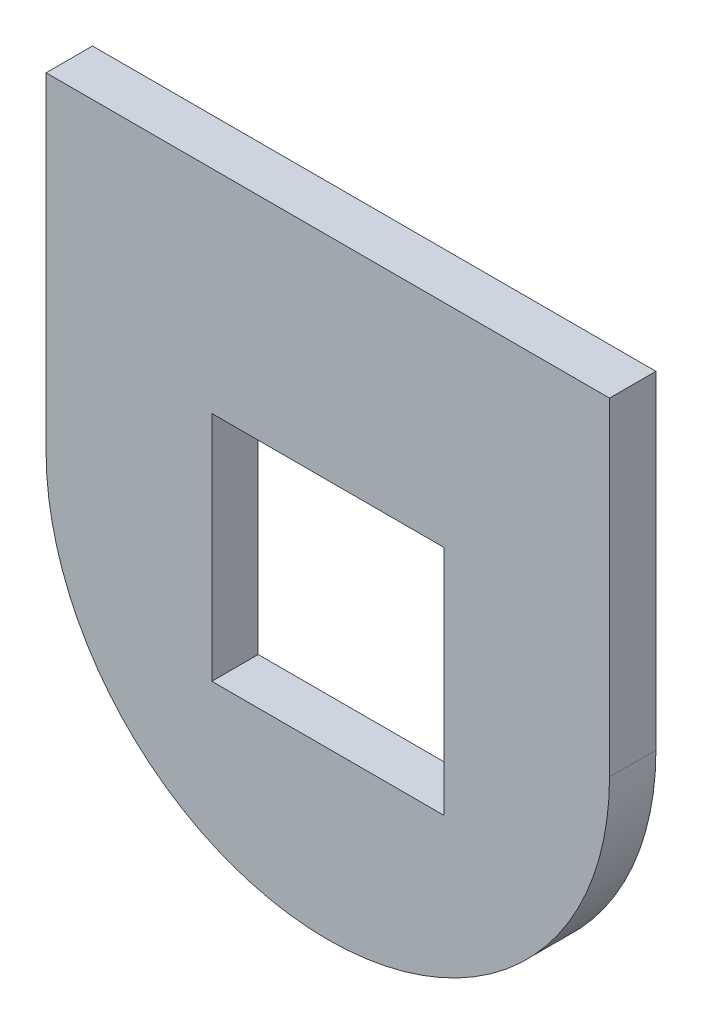
ISO-10303-21;
HEADER;
FILE_DESCRIPTION(('STEP AP214'),'2;1');
FILE_NAME('part.step','',(''),(''),'','','');
FILE_SCHEMA(('AUTOMOTIVE_DESIGN { 1 0 10303 214 1 1 1 1 }'));
ENDSEC;
DATA;
#1=APPLICATION_CONTEXT('core data for automotive mechanical design processes');
#2=APPLICATION_PROTOCOL_DEFINITION('international standard','automotive_design',2000,#1);
#3=PRODUCT_CONTEXT('',#1,'mechanical');
#4=PRODUCT('Part','Part','',(#3));
#5=PRODUCT_RELATED_PRODUCT_CATEGORY('part','',(#4));
#6=PRODUCT_DEFINITION_FORMATION('','',#4);
#7=PRODUCT_DEFINITION_CONTEXT('part definition',#1,'design');
#8=PRODUCT_DEFINITION('design','',#6,#7);
#9=PRODUCT_DEFINITION_SHAPE('','',#8);
#10=(LENGTH_UNIT() NAMED_UNIT(*) SI_UNIT(.MILLI.,.METRE.));
#11=(NAMED_UNIT(*) PLANE_ANGLE_UNIT() SI_UNIT($,.RADIAN.));
#12=(NAMED_UNIT(*) SI_UNIT($,.STERADIAN.) SOLID_ANGLE_UNIT());
#13=UNCERTAINTY_MEASURE_WITH_UNIT(LENGTH_MEASURE(1.E-05),#10,'distance_accuracy_value','');
#14=(GEOMETRIC_REPRESENTATION_CONTEXT(3) GLOBAL_UNCERTAINTY_ASSIGNED_CONTEXT((#13)) GLOBAL_UNIT_ASSIGNED_CONTEXT((#10,
#11,#12)) REPRESENTATION_CONTEXT('',''));
#15=CARTESIAN_POINT('',(0.,0.,0.));
#16=DIRECTION('',(0.,0.,1.));
#17=DIRECTION('',(1.,0.,0.));
#18=AXIS2_PLACEMENT_3D('',#15,#16,#17);
#19=CARTESIAN_POINT('',(85.,0.,7.));
#20=DIRECTION('',(-1.,0.,0.));
#21=DIRECTION('',(0.,0.,1.));
#22=AXIS2_PLACEMENT_3D('',#19,#20,#21);
#23=PLANE('',#22);
#24=DIRECTION('',(0.,1.,0.));
#25=VECTOR('',#24,1.);
#26=CARTESIAN_POINT('',(85.,0.,0.));
#27=LINE('',#26,#25);
#28=CARTESIAN_POINT('',(85.,45.,0.));
#29=VERTEX_POINT('',#28);
#30=CARTESIAN_POINT('',(85.,94.5,0.));
#31=VERTEX_POINT('',#30);
#32=EDGE_CURVE('E46',#29,#31,#27,.T.);
#33=ORIENTED_EDGE('',*,*,#32,.T.);
#34=DIRECTION('',(0.,0.,-1.));
#35=VECTOR('',#34,1.);
#36=CARTESIAN_POINT('',(85.,94.5,7.));
#37=LINE('',#36,#35);
#38=CARTESIAN_POINT('',(85.,94.5,7.));
#39=VERTEX_POINT('',#38);
#40=EDGE_CURVE('E60',#39,#31,#37,.T.);
#41=ORIENTED_EDGE('',*,*,#40,.F.);
#42=DIRECTION('',(0.,1.,0.));
#43=VECTOR('',#42,1.);
#44=CARTESIAN_POINT('',(85.,0.,7.));
#45=LINE('',#44,#43);
#46=CARTESIAN_POINT('',(85.,45.,7.));
#47=VERTEX_POINT('',#46);
#48=EDGE_CURVE('E11',#47,#39,#45,.T.);
#49=ORIENTED_EDGE('',*,*,#48,.F.);
#50=DIRECTION('',(0.,0.,-1.));
#51=VECTOR('',#50,1.);
#52=CARTESIAN_POINT('',(85.,45.,10.));
#53=LINE('',#52,#51);
#54=EDGE_CURVE('E191',#47,#29,#53,.T.);
#55=ORIENTED_EDGE('',*,*,#54,.T.);
#56=EDGE_LOOP('',(#33,#41,#49,#55));
#57=FACE_BOUND('',#56,.T.);
#58=ADVANCED_FACE('F42',(#57),#23,.F.);
#59=CARTESIAN_POINT('',(0.,0.,7.));
#60=DIRECTION('',(1.,0.,0.));
#61=DIRECTION('',(0.,0.,-1.));
#62=AXIS2_PLACEMENT_3D('',#59,#60,#61);
#63=PLANE('',#62);
#64=DIRECTION('',(0.,-1.,0.));
#65=VECTOR('',#64,1.);
#66=CARTESIAN_POINT('',(0.,0.,7.));
#67=LINE('',#66,#65);
#68=CARTESIAN_POINT('',(0.,94.5,7.));
#69=VERTEX_POINT('',#68);
#70=CARTESIAN_POINT('',(0.,45.,7.));
#71=VERTEX_POINT('',#70);
#72=EDGE_CURVE('E52',#69,#71,#67,.T.);
#73=ORIENTED_EDGE('',*,*,#72,.F.);
#74=DIRECTION('',(0.,0.,1.));
#75=VECTOR('',#74,1.);
#76=CARTESIAN_POINT('',(0.,94.5,7.));
#77=LINE('',#76,#75);
#78=CARTESIAN_POINT('',(0.,94.5,0.));
#79=VERTEX_POINT('',#78);
#80=EDGE_CURVE('E109',#79,#69,#77,.T.);
#81=ORIENTED_EDGE('',*,*,#80,.F.);
#82=DIRECTION('',(0.,-1.,0.));
#83=VECTOR('',#82,1.);
#84=CARTESIAN_POINT('',(0.,0.,0.));
#85=LINE('',#84,#83);
#86=CARTESIAN_POINT('',(0.,45.,0.));
#87=VERTEX_POINT('',#86);
#88=EDGE_CURVE('E68',#79,#87,#85,.T.);
#89=ORIENTED_EDGE('',*,*,#88,.T.);
#90=DIRECTION('',(0.,0.,-1.));
#91=VECTOR('',#90,1.);
#92=CARTESIAN_POINT('',(0.,45.,10.));
#93=LINE('',#92,#91);
#94=EDGE_CURVE('E124',#71,#87,#93,.T.);
#95=ORIENTED_EDGE('',*,*,#94,.F.);
#96=EDGE_LOOP('',(#73,#81,#89,#95));
#97=FACE_BOUND('',#96,.T.);
#98=ADVANCED_FACE('F44',(#97),#63,.F.);
#99=CARTESIAN_POINT('',(0.,0.,7.));
#100=DIRECTION('',(0.,0.,-1.));
#101=DIRECTION('',(-1.,0.,0.));
#102=AXIS2_PLACEMENT_3D('',#99,#100,#101);
#103=PLANE('',#102);
#104=DIRECTION('',(-1.,0.,0.));
#105=VECTOR('',#104,1.);
#106=CARTESIAN_POINT('',(25.,62.5,7.));
#107=LINE('',#106,#105);
#108=CARTESIAN_POINT('',(60.,62.5,7.));
#109=VERTEX_POINT('',#108);
#110=CARTESIAN_POINT('',(25.,62.5,7.));
#111=VERTEX_POINT('',#110);
#112=EDGE_CURVE('E173',#109,#111,#107,.T.);
#113=ORIENTED_EDGE('',*,*,#112,.F.);
#114=DIRECTION('',(0.,1.,0.));
#115=VECTOR('',#114,1.);
#116=CARTESIAN_POINT('',(60.,27.5,7.));
#117=LINE('',#116,#115);
#118=CARTESIAN_POINT('',(60.,27.5,7.));
#119=VERTEX_POINT('',#118);
#120=EDGE_CURVE('E170',#119,#109,#117,.T.);
#121=ORIENTED_EDGE('',*,*,#120,.F.);
#122=DIRECTION('',(1.,0.,0.));
#123=VECTOR('',#122,1.);
#124=CARTESIAN_POINT('',(25.,27.5,7.));
#125=LINE('',#124,#123);
#126=CARTESIAN_POINT('',(25.,27.5,7.));
#127=VERTEX_POINT('',#126);
#128=EDGE_CURVE('E144',#127,#119,#125,.T.);
#129=ORIENTED_EDGE('',*,*,#128,.F.);
#130=DIRECTION('',(0.,-1.,0.));
#131=VECTOR('',#130,1.);
#132=CARTESIAN_POINT('',(25.,27.5,7.));
#133=LINE('',#132,#131);
#134=EDGE_CURVE('E176',#111,#127,#133,.T.);
#135=ORIENTED_EDGE('',*,*,#134,.F.);
#136=EDGE_LOOP('',(#113,#121,#129,#135));
#137=FACE_BOUND('',#136,.T.);
#138=ORIENTED_EDGE('',*,*,#48,.T.);
#139=DIRECTION('',(1.,0.,0.));
#140=VECTOR('',#139,1.);
#141=CARTESIAN_POINT('',(0.,94.5,7.));
#142=LINE('',#141,#140);
#143=EDGE_CURVE('E112',#69,#39,#142,.T.);
#144=ORIENTED_EDGE('',*,*,#143,.F.);
#145=ORIENTED_EDGE('',*,*,#72,.T.);
#146=CARTESIAN_POINT('',(42.5,45.,7.));
#147=DIRECTION('',(0.,0.,-1.));
#148=DIRECTION('',(-1.,0.,0.));
#149=AXIS2_PLACEMENT_3D('',#146,#147,#148);
#150=CIRCLE('',#149,42.5);
#151=EDGE_CURVE('E174',#71,#47,#150,.F.);
#152=ORIENTED_EDGE('',*,*,#151,.T.);
#153=EDGE_LOOP('',(#138,#144,#145,#152));
#154=FACE_BOUND('',#153,.T.);
#155=ADVANCED_FACE('F118',(#137,#154),#103,.F.);
#156=CARTESIAN_POINT('',(0.,0.,0.));
#157=DIRECTION('',(0.,0.,-1.));
#158=DIRECTION('',(-1.,0.,0.));
#159=AXIS2_PLACEMENT_3D('',#156,#157,#158);
#160=PLANE('',#159);
#161=DIRECTION('',(-1.,0.,0.));
#162=VECTOR('',#161,1.);
#163=CARTESIAN_POINT('',(0.,94.5,0.));
#164=LINE('',#163,#162);
#165=EDGE_CURVE('E113',#31,#79,#164,.T.);
#166=ORIENTED_EDGE('',*,*,#165,.F.);
#167=ORIENTED_EDGE('',*,*,#32,.F.);
#168=CARTESIAN_POINT('',(42.5,45.,0.));
#169=DIRECTION('',(0.,0.,1.));
#170=DIRECTION('',(-1.,0.,0.));
#171=AXIS2_PLACEMENT_3D('',#168,#169,#170);
#172=CIRCLE('',#171,42.5);
#173=EDGE_CURVE('E195',#87,#29,#172,.T.);
#174=ORIENTED_EDGE('',*,*,#173,.F.);
#175=ORIENTED_EDGE('',*,*,#88,.F.);
#176=EDGE_LOOP('',(#166,#167,#174,#175));
#177=FACE_BOUND('',#176,.T.);
#178=DIRECTION('',(0.,1.,0.));
#179=VECTOR('',#178,1.);
#180=CARTESIAN_POINT('',(60.,27.5,0.));
#181=LINE('',#180,#179);
#182=CARTESIAN_POINT('',(60.,27.5,0.));
#183=VERTEX_POINT('',#182);
#184=CARTESIAN_POINT('',(60.,62.5,0.));
#185=VERTEX_POINT('',#184);
#186=EDGE_CURVE('E181',#183,#185,#181,.T.);
#187=ORIENTED_EDGE('',*,*,#186,.T.);
#188=DIRECTION('',(-1.,0.,0.));
#189=VECTOR('',#188,1.);
#190=CARTESIAN_POINT('',(25.,62.5,0.));
#191=LINE('',#190,#189);
#192=CARTESIAN_POINT('',(25.,62.5,0.));
#193=VERTEX_POINT('',#192);
#194=EDGE_CURVE('E166',#185,#193,#191,.T.);
#195=ORIENTED_EDGE('',*,*,#194,.T.);
#196=DIRECTION('',(0.,-1.,0.));
#197=VECTOR('',#196,1.);
#198=CARTESIAN_POINT('',(25.,27.5,0.));
#199=LINE('',#198,#197);
#200=CARTESIAN_POINT('',(25.,27.5,0.));
#201=VERTEX_POINT('',#200);
#202=EDGE_CURVE('E159',#193,#201,#199,.T.);
#203=ORIENTED_EDGE('',*,*,#202,.T.);
#204=DIRECTION('',(1.,0.,0.));
#205=VECTOR('',#204,1.);
#206=CARTESIAN_POINT('',(25.,27.5,0.));
#207=LINE('',#206,#205);
#208=EDGE_CURVE('E153',#201,#183,#207,.T.);
#209=ORIENTED_EDGE('',*,*,#208,.T.);
#210=EDGE_LOOP('',(#187,#195,#203,#209));
#211=FACE_BOUND('',#210,.T.);
#212=ADVANCED_FACE('F209',(#177,#211),#160,.T.);
#213=CARTESIAN_POINT('',(60.,27.5,0.));
#214=DIRECTION('',(1.,0.,0.));
#215=DIRECTION('',(0.,0.,-1.));
#216=AXIS2_PLACEMENT_3D('',#213,#214,#215);
#217=PLANE('',#216);
#218=ORIENTED_EDGE('',*,*,#120,.T.);
#219=DIRECTION('',(0.,0.,1.));
#220=VECTOR('',#219,1.);
#221=CARTESIAN_POINT('',(60.,62.5,0.));
#222=LINE('',#221,#220);
#223=EDGE_CURVE('E130',#185,#109,#222,.T.);
#224=ORIENTED_EDGE('',*,*,#223,.F.);
#225=ORIENTED_EDGE('',*,*,#186,.F.);
#226=DIRECTION('',(0.,0.,1.));
#227=VECTOR('',#226,1.);
#228=CARTESIAN_POINT('',(60.,27.5,0.));
#229=LINE('',#228,#227);
#230=EDGE_CURVE('E133',#183,#119,#229,.T.);
#231=ORIENTED_EDGE('',*,*,#230,.T.);
#232=EDGE_LOOP('',(#218,#224,#225,#231));
#233=FACE_BOUND('',#232,.T.);
#234=ADVANCED_FACE('F211',(#233),#217,.F.);
#235=CARTESIAN_POINT('',(25.,27.5,0.));
#236=DIRECTION('',(0.,-1.,0.));
#237=DIRECTION('',(0.,0.,-1.));
#238=AXIS2_PLACEMENT_3D('',#235,#236,#237);
#239=PLANE('',#238);
#240=ORIENTED_EDGE('',*,*,#128,.T.);
#241=ORIENTED_EDGE('',*,*,#230,.F.);
#242=ORIENTED_EDGE('',*,*,#208,.F.);
#243=DIRECTION('',(0.,0.,1.));
#244=VECTOR('',#243,1.);
#245=CARTESIAN_POINT('',(25.,27.5,0.));
#246=LINE('',#245,#244);
#247=EDGE_CURVE('E135',#201,#127,#246,.T.);
#248=ORIENTED_EDGE('',*,*,#247,.T.);
#249=EDGE_LOOP('',(#240,#241,#242,#248));
#250=FACE_BOUND('',#249,.T.);
#251=ADVANCED_FACE('F217',(#250),#239,.F.);
#252=CARTESIAN_POINT('',(25.,27.5,0.));
#253=DIRECTION('',(-1.,0.,0.));
#254=DIRECTION('',(0.,0.,1.));
#255=AXIS2_PLACEMENT_3D('',#252,#253,#254);
#256=PLANE('',#255);
#257=ORIENTED_EDGE('',*,*,#134,.T.);
#258=ORIENTED_EDGE('',*,*,#247,.F.);
#259=ORIENTED_EDGE('',*,*,#202,.F.);
#260=DIRECTION('',(0.,0.,1.));
#261=VECTOR('',#260,1.);
#262=CARTESIAN_POINT('',(25.,62.5,0.));
#263=LINE('',#262,#261);
#264=EDGE_CURVE('E141',#193,#111,#263,.T.);
#265=ORIENTED_EDGE('',*,*,#264,.T.);
#266=EDGE_LOOP('',(#257,#258,#259,#265));
#267=FACE_BOUND('',#266,.T.);
#268=ADVANCED_FACE('F262',(#267),#256,.F.);
#269=CARTESIAN_POINT('',(25.,62.5,0.));
#270=DIRECTION('',(0.,1.,0.));
#271=DIRECTION('',(0.,0.,1.));
#272=AXIS2_PLACEMENT_3D('',#269,#270,#271);
#273=PLANE('',#272);
#274=ORIENTED_EDGE('',*,*,#112,.T.);
#275=ORIENTED_EDGE('',*,*,#264,.F.);
#276=ORIENTED_EDGE('',*,*,#194,.F.);
#277=ORIENTED_EDGE('',*,*,#223,.T.);
#278=EDGE_LOOP('',(#274,#275,#276,#277));
#279=FACE_BOUND('',#278,.T.);
#280=ADVANCED_FACE('F256',(#279),#273,.F.);
#281=CARTESIAN_POINT('',(42.5,45.,10.));
#282=DIRECTION('',(0.,0.,-1.));
#283=DIRECTION('',(-1.,0.,0.));
#284=AXIS2_PLACEMENT_3D('',#281,#282,#283);
#285=CYLINDRICAL_SURFACE('',#284,42.5);
#286=ORIENTED_EDGE('',*,*,#94,.T.);
#287=ORIENTED_EDGE('',*,*,#173,.T.);
#288=ORIENTED_EDGE('',*,*,#54,.F.);
#289=ORIENTED_EDGE('',*,*,#151,.F.);
#290=EDGE_LOOP('',(#286,#287,#288,#289));
#291=FACE_BOUND('',#290,.T.);
#292=ADVANCED_FACE('F205',(#291),#285,.T.);
#293=CARTESIAN_POINT('',(0.,94.5,0.));
#294=DIRECTION('',(0.,-1.,0.));
#295=DIRECTION('',(0.,0.,-1.));
#296=AXIS2_PLACEMENT_3D('',#293,#294,#295);
#297=PLANE('',#296);
#298=ORIENTED_EDGE('',*,*,#80,.T.);
#299=ORIENTED_EDGE('',*,*,#143,.T.);
#300=ORIENTED_EDGE('',*,*,#40,.T.);
#301=ORIENTED_EDGE('',*,*,#165,.T.);
#302=EDGE_LOOP('',(#298,#299,#300,#301));
#303=FACE_BOUND('',#302,.T.);
#304=ADVANCED_FACE('F111',(#303),#297,.F.);
#305=CLOSED_SHELL('',(#58,#98,#155,#212,#234,#251,#268,#280,#292,#304));
#306=MANIFOLD_SOLID_BREP('B2',#305);
#307=ADVANCED_BREP_SHAPE_REPRESENTATION('',(#18,#306),#14);
#308=SHAPE_DEFINITION_REPRESENTATION(#9,#307);
ENDSEC;
END-ISO-10303-21;
